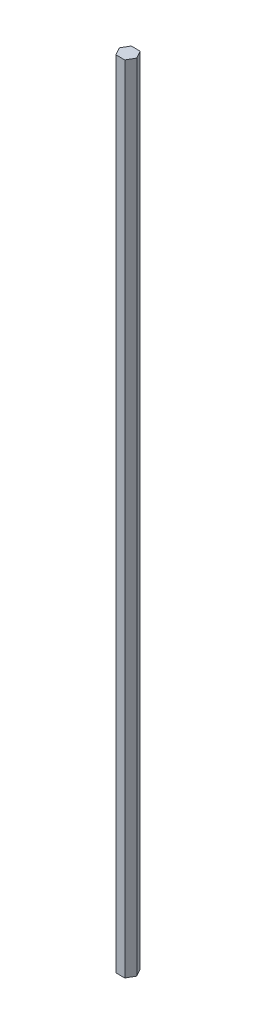
ISO-10303-21;
HEADER;
FILE_DESCRIPTION(('STEP AP214'),'2;1');
FILE_NAME('part.step','',(''),(''),'','','');
FILE_SCHEMA(('AUTOMOTIVE_DESIGN { 1 0 10303 214 1 1 1 1 }'));
ENDSEC;
DATA;
#1=APPLICATION_CONTEXT('core data for automotive mechanical design processes');
#2=APPLICATION_PROTOCOL_DEFINITION('international standard','automotive_design',2000,#1);
#3=PRODUCT_CONTEXT('',#1,'mechanical');
#4=PRODUCT('Part','Part','',(#3));
#5=PRODUCT_RELATED_PRODUCT_CATEGORY('part','',(#4));
#6=PRODUCT_DEFINITION_FORMATION('','',#4);
#7=PRODUCT_DEFINITION_CONTEXT('part definition',#1,'design');
#8=PRODUCT_DEFINITION('design','',#6,#7);
#9=PRODUCT_DEFINITION_SHAPE('','',#8);
#10=(LENGTH_UNIT() NAMED_UNIT(*) SI_UNIT(.MILLI.,.METRE.));
#11=(NAMED_UNIT(*) PLANE_ANGLE_UNIT() SI_UNIT($,.RADIAN.));
#12=(NAMED_UNIT(*) SI_UNIT($,.STERADIAN.) SOLID_ANGLE_UNIT());
#13=UNCERTAINTY_MEASURE_WITH_UNIT(LENGTH_MEASURE(1.E-05),#10,'distance_accuracy_value','');
#14=(GEOMETRIC_REPRESENTATION_CONTEXT(3) GLOBAL_UNCERTAINTY_ASSIGNED_CONTEXT((#13)) GLOBAL_UNIT_ASSIGNED_CONTEXT((#10,
#11,#12)) REPRESENTATION_CONTEXT('',''));
#15=CARTESIAN_POINT('',(0.,0.,0.));
#16=DIRECTION('',(0.,0.,1.));
#17=DIRECTION('',(1.,0.,0.));
#18=AXIS2_PLACEMENT_3D('',#15,#16,#17);
#19=CARTESIAN_POINT('',(-3.66617420935412,660.4,6.35));
#20=DIRECTION('',(0.,0.,-1.));
#21=DIRECTION('',(-1.,0.,0.));
#22=AXIS2_PLACEMENT_3D('',#19,#20,#21);
#23=PLANE('',#22);
#24=DIRECTION('',(1.,0.,0.));
#25=VECTOR('',#24,1.);
#26=CARTESIAN_POINT('',(-3.66617420935412,0.,6.35));
#27=LINE('',#26,#25);
#28=CARTESIAN_POINT('',(-3.66617420935412,0.,6.35));
#29=VERTEX_POINT('',#28);
#30=CARTESIAN_POINT('',(3.66617420935412,0.,6.35));
#31=VERTEX_POINT('',#30);
#32=EDGE_CURVE('E132',#29,#31,#27,.T.);
#33=ORIENTED_EDGE('',*,*,#32,.T.);
#34=DIRECTION('',(0.,-1.,0.));
#35=VECTOR('',#34,1.);
#36=CARTESIAN_POINT('',(3.66617420935412,660.4,6.35));
#37=LINE('',#36,#35);
#38=CARTESIAN_POINT('',(3.66617420935412,660.4,6.35));
#39=VERTEX_POINT('',#38);
#40=EDGE_CURVE('E11',#39,#31,#37,.T.);
#41=ORIENTED_EDGE('',*,*,#40,.F.);
#42=DIRECTION('',(1.,0.,0.));
#43=VECTOR('',#42,1.);
#44=CARTESIAN_POINT('',(-3.66617420935412,660.4,6.35));
#45=LINE('',#44,#43);
#46=CARTESIAN_POINT('',(-3.66617420935412,660.4,6.35));
#47=VERTEX_POINT('',#46);
#48=EDGE_CURVE('E148',#47,#39,#45,.T.);
#49=ORIENTED_EDGE('',*,*,#48,.F.);
#50=DIRECTION('',(0.,-1.,0.));
#51=VECTOR('',#50,1.);
#52=CARTESIAN_POINT('',(-3.66617420935412,660.4,6.35));
#53=LINE('',#52,#51);
#54=EDGE_CURVE('E128',#47,#29,#53,.T.);
#55=ORIENTED_EDGE('',*,*,#54,.T.);
#56=EDGE_LOOP('',(#33,#41,#49,#55));
#57=FACE_BOUND('',#56,.T.);
#58=ADVANCED_FACE('F43',(#57),#23,.F.);
#59=CARTESIAN_POINT('',(3.66617420935412,660.4,6.35));
#60=DIRECTION('',(-0.866025403784438,0.,-0.5));
#61=DIRECTION('',(-0.5,0.,0.866025403784439));
#62=AXIS2_PLACEMENT_3D('',#59,#60,#61);
#63=PLANE('',#62);
#64=DIRECTION('',(0.5,0.,-0.866025403784438));
#65=VECTOR('',#64,1.);
#66=CARTESIAN_POINT('',(3.66617420935412,0.,6.35));
#67=LINE('',#66,#65);
#68=CARTESIAN_POINT('',(7.33234841870824,0.,0.));
#69=VERTEX_POINT('',#68);
#70=EDGE_CURVE('E136',#31,#69,#67,.T.);
#71=ORIENTED_EDGE('',*,*,#70,.T.);
#72=DIRECTION('',(0.,-1.,0.));
#73=VECTOR('',#72,1.);
#74=CARTESIAN_POINT('',(7.33234841870824,660.4,0.));
#75=LINE('',#74,#73);
#76=CARTESIAN_POINT('',(7.33234841870824,660.4,0.));
#77=VERTEX_POINT('',#76);
#78=EDGE_CURVE('E52',#77,#69,#75,.T.);
#79=ORIENTED_EDGE('',*,*,#78,.F.);
#80=DIRECTION('',(0.5,0.,-0.866025403784438));
#81=VECTOR('',#80,1.);
#82=CARTESIAN_POINT('',(3.66617420935412,660.4,6.35));
#83=LINE('',#82,#81);
#84=EDGE_CURVE('E97',#39,#77,#83,.T.);
#85=ORIENTED_EDGE('',*,*,#84,.F.);
#86=ORIENTED_EDGE('',*,*,#40,.T.);
#87=EDGE_LOOP('',(#71,#79,#85,#86));
#88=FACE_BOUND('',#87,.T.);
#89=ADVANCED_FACE('F176',(#88),#63,.F.);
#90=CARTESIAN_POINT('',(7.33234841870824,660.4,0.));
#91=DIRECTION('',(-0.866025403784439,0.,0.5));
#92=DIRECTION('',(0.5,0.,0.866025403784439));
#93=AXIS2_PLACEMENT_3D('',#90,#91,#92);
#94=PLANE('',#93);
#95=DIRECTION('',(-0.5,0.,-0.866025403784439));
#96=VECTOR('',#95,1.);
#97=CARTESIAN_POINT('',(7.33234841870824,0.,0.));
#98=LINE('',#97,#96);
#99=CARTESIAN_POINT('',(3.66617420935412,0.,-6.35));
#100=VERTEX_POINT('',#99);
#101=EDGE_CURVE('E139',#69,#100,#98,.T.);
#102=ORIENTED_EDGE('',*,*,#101,.T.);
#103=DIRECTION('',(0.,-1.,0.));
#104=VECTOR('',#103,1.);
#105=CARTESIAN_POINT('',(3.66617420935412,660.4,-6.35));
#106=LINE('',#105,#104);
#107=CARTESIAN_POINT('',(3.66617420935412,660.4,-6.35));
#108=VERTEX_POINT('',#107);
#109=EDGE_CURVE('E121',#108,#100,#106,.T.);
#110=ORIENTED_EDGE('',*,*,#109,.F.);
#111=DIRECTION('',(-0.5,0.,-0.866025403784439));
#112=VECTOR('',#111,1.);
#113=CARTESIAN_POINT('',(7.33234841870824,660.4,0.));
#114=LINE('',#113,#112);
#115=EDGE_CURVE('E110',#77,#108,#114,.T.);
#116=ORIENTED_EDGE('',*,*,#115,.F.);
#117=ORIENTED_EDGE('',*,*,#78,.T.);
#118=EDGE_LOOP('',(#102,#110,#116,#117));
#119=FACE_BOUND('',#118,.T.);
#120=ADVANCED_FACE('F158',(#119),#94,.F.);
#121=CARTESIAN_POINT('',(3.66617420935412,660.4,-6.35));
#122=DIRECTION('',(0.,0.,1.));
#123=DIRECTION('',(1.,0.,0.));
#124=AXIS2_PLACEMENT_3D('',#121,#122,#123);
#125=PLANE('',#124);
#126=DIRECTION('',(-1.,0.,0.));
#127=VECTOR('',#126,1.);
#128=CARTESIAN_POINT('',(3.66617420935412,0.,-6.35));
#129=LINE('',#128,#127);
#130=CARTESIAN_POINT('',(-3.66617420935412,0.,-6.35));
#131=VERTEX_POINT('',#130);
#132=EDGE_CURVE('E119',#100,#131,#129,.T.);
#133=ORIENTED_EDGE('',*,*,#132,.T.);
#134=DIRECTION('',(0.,-1.,0.));
#135=VECTOR('',#134,1.);
#136=CARTESIAN_POINT('',(-3.66617420935412,660.4,-6.35));
#137=LINE('',#136,#135);
#138=CARTESIAN_POINT('',(-3.66617420935412,660.4,-6.35));
#139=VERTEX_POINT('',#138);
#140=EDGE_CURVE('E116',#139,#131,#137,.T.);
#141=ORIENTED_EDGE('',*,*,#140,.F.);
#142=DIRECTION('',(-1.,0.,0.));
#143=VECTOR('',#142,1.);
#144=CARTESIAN_POINT('',(3.66617420935412,660.4,-6.35));
#145=LINE('',#144,#143);
#146=EDGE_CURVE('E104',#108,#139,#145,.T.);
#147=ORIENTED_EDGE('',*,*,#146,.F.);
#148=ORIENTED_EDGE('',*,*,#109,.T.);
#149=EDGE_LOOP('',(#133,#141,#147,#148));
#150=FACE_BOUND('',#149,.T.);
#151=ADVANCED_FACE('F117',(#150),#125,.F.);
#152=CARTESIAN_POINT('',(-3.66617420935412,660.4,-6.35));
#153=DIRECTION('',(0.866025403784438,0.,0.5));
#154=DIRECTION('',(0.5,0.,-0.866025403784439));
#155=AXIS2_PLACEMENT_3D('',#152,#153,#154);
#156=PLANE('',#155);
#157=DIRECTION('',(-0.5,0.,0.866025403784439));
#158=VECTOR('',#157,1.);
#159=CARTESIAN_POINT('',(-3.66617420935412,0.,-6.35));
#160=LINE('',#159,#158);
#161=CARTESIAN_POINT('',(-7.33234841870824,0.,0.));
#162=VERTEX_POINT('',#161);
#163=EDGE_CURVE('E83',#131,#162,#160,.T.);
#164=ORIENTED_EDGE('',*,*,#163,.T.);
#165=DIRECTION('',(0.,-1.,0.));
#166=VECTOR('',#165,1.);
#167=CARTESIAN_POINT('',(-7.33234841870824,660.4,0.));
#168=LINE('',#167,#166);
#169=CARTESIAN_POINT('',(-7.33234841870824,660.4,0.));
#170=VERTEX_POINT('',#169);
#171=EDGE_CURVE('E122',#170,#162,#168,.T.);
#172=ORIENTED_EDGE('',*,*,#171,.F.);
#173=DIRECTION('',(-0.5,0.,0.866025403784439));
#174=VECTOR('',#173,1.);
#175=CARTESIAN_POINT('',(-3.66617420935412,660.4,-6.35));
#176=LINE('',#175,#174);
#177=EDGE_CURVE('E108',#139,#170,#176,.T.);
#178=ORIENTED_EDGE('',*,*,#177,.F.);
#179=ORIENTED_EDGE('',*,*,#140,.T.);
#180=EDGE_LOOP('',(#164,#172,#178,#179));
#181=FACE_BOUND('',#180,.T.);
#182=ADVANCED_FACE('F124',(#181),#156,.F.);
#183=CARTESIAN_POINT('',(-7.33234841870824,660.4,0.));
#184=DIRECTION('',(0.866025403784439,0.,-0.5));
#185=DIRECTION('',(-0.5,0.,-0.866025403784439));
#186=AXIS2_PLACEMENT_3D('',#183,#184,#185);
#187=PLANE('',#186);
#188=DIRECTION('',(0.5,0.,0.866025403784439));
#189=VECTOR('',#188,1.);
#190=CARTESIAN_POINT('',(-7.33234841870824,0.,0.));
#191=LINE('',#190,#189);
#192=EDGE_CURVE('E89',#162,#29,#191,.T.);
#193=ORIENTED_EDGE('',*,*,#192,.T.);
#194=ORIENTED_EDGE('',*,*,#54,.F.);
#195=DIRECTION('',(0.5,0.,0.866025403784439));
#196=VECTOR('',#195,1.);
#197=CARTESIAN_POINT('',(-7.33234841870824,660.4,0.));
#198=LINE('',#197,#196);
#199=EDGE_CURVE('E60',#170,#47,#198,.T.);
#200=ORIENTED_EDGE('',*,*,#199,.F.);
#201=ORIENTED_EDGE('',*,*,#171,.T.);
#202=EDGE_LOOP('',(#193,#194,#200,#201));
#203=FACE_BOUND('',#202,.T.);
#204=ADVANCED_FACE('F165',(#203),#187,.F.);
#205=CARTESIAN_POINT('',(0.,660.4,0.));
#206=DIRECTION('',(0.,1.,0.));
#207=DIRECTION('',(0.,0.,1.));
#208=AXIS2_PLACEMENT_3D('',#205,#206,#207);
#209=PLANE('',#208);
#210=ORIENTED_EDGE('',*,*,#48,.T.);
#211=ORIENTED_EDGE('',*,*,#84,.T.);
#212=ORIENTED_EDGE('',*,*,#115,.T.);
#213=ORIENTED_EDGE('',*,*,#146,.T.);
#214=ORIENTED_EDGE('',*,*,#177,.T.);
#215=ORIENTED_EDGE('',*,*,#199,.T.);
#216=EDGE_LOOP('',(#210,#211,#212,#213,#214,#215));
#217=FACE_BOUND('',#216,.T.);
#218=ADVANCED_FACE('F106',(#217),#209,.T.);
#219=CARTESIAN_POINT('',(0.,0.,0.));
#220=DIRECTION('',(0.,1.,0.));
#221=DIRECTION('',(0.,0.,1.));
#222=AXIS2_PLACEMENT_3D('',#219,#220,#221);
#223=PLANE('',#222);
#224=ORIENTED_EDGE('',*,*,#32,.F.);
#225=ORIENTED_EDGE('',*,*,#192,.F.);
#226=ORIENTED_EDGE('',*,*,#163,.F.);
#227=ORIENTED_EDGE('',*,*,#132,.F.);
#228=ORIENTED_EDGE('',*,*,#101,.F.);
#229=ORIENTED_EDGE('',*,*,#70,.F.);
#230=EDGE_LOOP('',(#224,#225,#226,#227,#228,#229));
#231=FACE_BOUND('',#230,.T.);
#232=ADVANCED_FACE('F161',(#231),#223,.F.);
#233=CLOSED_SHELL('',(#58,#89,#120,#151,#182,#204,#218,#232));
#234=MANIFOLD_SOLID_BREP('B2',#233);
#235=ADVANCED_BREP_SHAPE_REPRESENTATION('',(#18,#234),#14);
#236=SHAPE_DEFINITION_REPRESENTATION(#9,#235);
ENDSEC;
END-ISO-10303-21;
